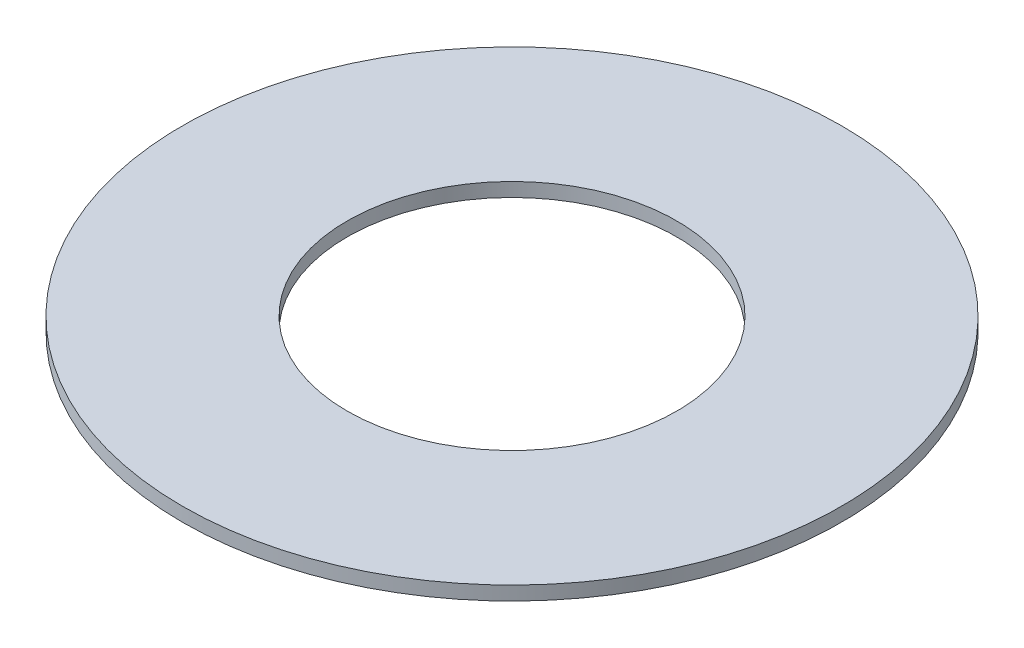
ISO-10303-21;
HEADER;
FILE_DESCRIPTION(('STEP AP214'),'2;1');
FILE_NAME('part.step','',(''),(''),'','','');
FILE_SCHEMA(('AUTOMOTIVE_DESIGN { 1 0 10303 214 1 1 1 1 }'));
ENDSEC;
DATA;
#1=APPLICATION_CONTEXT('core data for automotive mechanical design processes');
#2=APPLICATION_PROTOCOL_DEFINITION('international standard','automotive_design',2000,#1);
#3=PRODUCT_CONTEXT('',#1,'mechanical');
#4=PRODUCT('Part','Part','',(#3));
#5=PRODUCT_RELATED_PRODUCT_CATEGORY('part','',(#4));
#6=PRODUCT_DEFINITION_FORMATION('','',#4);
#7=PRODUCT_DEFINITION_CONTEXT('part definition',#1,'design');
#8=PRODUCT_DEFINITION('design','',#6,#7);
#9=PRODUCT_DEFINITION_SHAPE('','',#8);
#10=(LENGTH_UNIT() NAMED_UNIT(*) SI_UNIT(.MILLI.,.METRE.));
#11=(NAMED_UNIT(*) PLANE_ANGLE_UNIT() SI_UNIT($,.RADIAN.));
#12=(NAMED_UNIT(*) SI_UNIT($,.STERADIAN.) SOLID_ANGLE_UNIT());
#13=UNCERTAINTY_MEASURE_WITH_UNIT(LENGTH_MEASURE(1.E-05),#10,'distance_accuracy_value','');
#14=(GEOMETRIC_REPRESENTATION_CONTEXT(3) GLOBAL_UNCERTAINTY_ASSIGNED_CONTEXT((#13)) GLOBAL_UNIT_ASSIGNED_CONTEXT((#10,
#11,#12)) REPRESENTATION_CONTEXT('',''));
#15=CARTESIAN_POINT('',(0.,0.,0.));
#16=DIRECTION('',(0.,0.,1.));
#17=DIRECTION('',(1.,0.,0.));
#18=AXIS2_PLACEMENT_3D('',#15,#16,#17);
#19=CARTESIAN_POINT('',(0.,4.,0.));
#20=DIRECTION('',(0.,-1.,0.));
#21=DIRECTION('',(0.,0.,-1.));
#22=AXIS2_PLACEMENT_3D('',#19,#20,#21);
#23=CYLINDRICAL_SURFACE('',#22,95.);
#24=CARTESIAN_POINT('',(0.,4.,0.));
#25=DIRECTION('',(0.,1.,0.));
#26=DIRECTION('',(0.,0.,1.));
#27=AXIS2_PLACEMENT_3D('',#24,#25,#26);
#28=CIRCLE('',#27,95.);
#29=CARTESIAN_POINT('',(0.,4.,95.));
#30=VERTEX_POINT('',#29);
#31=EDGE_CURVE('E10',#30,#30,#28,.T.);
#32=ORIENTED_EDGE('',*,*,#31,.F.);
#33=EDGE_LOOP('',(#32));
#34=FACE_BOUND('',#33,.T.);
#35=CARTESIAN_POINT('',(0.,0.,0.));
#36=DIRECTION('',(0.,1.,0.));
#37=DIRECTION('',(0.,0.,1.));
#38=AXIS2_PLACEMENT_3D('',#35,#36,#37);
#39=CIRCLE('',#38,95.);
#40=CARTESIAN_POINT('',(0.,0.,95.));
#41=VERTEX_POINT('',#40);
#42=EDGE_CURVE('E37',#41,#41,#39,.T.);
#43=ORIENTED_EDGE('',*,*,#42,.T.);
#44=EDGE_LOOP('',(#43));
#45=FACE_BOUND('',#44,.T.);
#46=ADVANCED_FACE('F40',(#34,#45),#23,.T.);
#47=CARTESIAN_POINT('',(0.,4.,0.));
#48=DIRECTION('',(0.,1.,0.));
#49=DIRECTION('',(0.,0.,1.));
#50=AXIS2_PLACEMENT_3D('',#47,#48,#49);
#51=PLANE('',#50);
#52=CARTESIAN_POINT('',(0.,4.,0.));
#53=DIRECTION('',(0.,1.,0.));
#54=DIRECTION('',(0.,0.,1.));
#55=AXIS2_PLACEMENT_3D('',#52,#53,#54);
#56=CIRCLE('',#55,47.5);
#57=CARTESIAN_POINT('',(0.,4.,47.5));
#58=VERTEX_POINT('',#57);
#59=EDGE_CURVE('E50',#58,#58,#56,.T.);
#60=ORIENTED_EDGE('',*,*,#59,.F.);
#61=EDGE_LOOP('',(#60));
#62=FACE_BOUND('',#61,.T.);
#63=ORIENTED_EDGE('',*,*,#31,.T.);
#64=EDGE_LOOP('',(#63));
#65=FACE_BOUND('',#64,.T.);
#66=ADVANCED_FACE('F59',(#62,#65),#51,.T.);
#67=CARTESIAN_POINT('',(0.,0.,0.));
#68=DIRECTION('',(0.,1.,0.));
#69=DIRECTION('',(0.,0.,1.));
#70=AXIS2_PLACEMENT_3D('',#67,#68,#69);
#71=PLANE('',#70);
#72=CARTESIAN_POINT('',(0.,0.,0.));
#73=DIRECTION('',(0.,1.,0.));
#74=DIRECTION('',(0.,0.,1.));
#75=AXIS2_PLACEMENT_3D('',#72,#73,#74);
#76=CIRCLE('',#75,47.5);
#77=CARTESIAN_POINT('',(0.,0.,47.5));
#78=VERTEX_POINT('',#77);
#79=EDGE_CURVE('E47',#78,#78,#76,.T.);
#80=ORIENTED_EDGE('',*,*,#79,.T.);
#81=EDGE_LOOP('',(#80));
#82=FACE_BOUND('',#81,.T.);
#83=ORIENTED_EDGE('',*,*,#42,.F.);
#84=EDGE_LOOP('',(#83));
#85=FACE_BOUND('',#84,.T.);
#86=ADVANCED_FACE('F58',(#82,#85),#71,.F.);
#87=CARTESIAN_POINT('',(0.,4.,0.));
#88=DIRECTION('',(0.,-1.,0.));
#89=DIRECTION('',(0.,0.,-1.));
#90=AXIS2_PLACEMENT_3D('',#87,#88,#89);
#91=CYLINDRICAL_SURFACE('',#90,47.5);
#92=ORIENTED_EDGE('',*,*,#59,.T.);
#93=EDGE_LOOP('',(#92));
#94=FACE_BOUND('',#93,.T.);
#95=ORIENTED_EDGE('',*,*,#79,.F.);
#96=EDGE_LOOP('',(#95));
#97=FACE_BOUND('',#96,.T.);
#98=ADVANCED_FACE('F54',(#94,#97),#91,.F.);
#99=CLOSED_SHELL('',(#46,#66,#86,#98));
#100=MANIFOLD_SOLID_BREP('B2',#99);
#101=ADVANCED_BREP_SHAPE_REPRESENTATION('',(#18,#100),#14);
#102=SHAPE_DEFINITION_REPRESENTATION(#9,#101);
ENDSEC;
END-ISO-10303-21;
